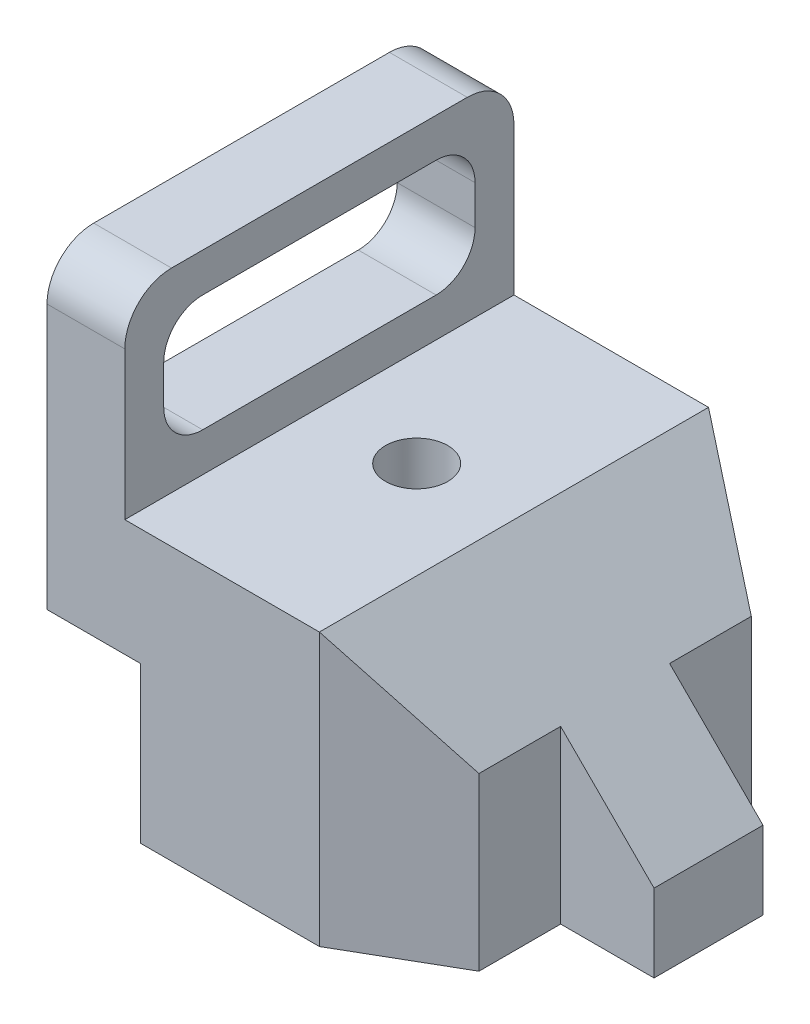
ISO-10303-21;
HEADER;
FILE_DESCRIPTION(('STEP AP214'),'2;1');
FILE_NAME('part.step','',(''),(''),'','','');
FILE_SCHEMA(('AUTOMOTIVE_DESIGN { 1 0 10303 214 1 1 1 1 }'));
ENDSEC;
DATA;
#1=APPLICATION_CONTEXT('core data for automotive mechanical design processes');
#2=APPLICATION_PROTOCOL_DEFINITION('international standard','automotive_design',2000,#1);
#3=PRODUCT_CONTEXT('',#1,'mechanical');
#4=PRODUCT('Part','Part','',(#3));
#5=PRODUCT_RELATED_PRODUCT_CATEGORY('part','',(#4));
#6=PRODUCT_DEFINITION_FORMATION('','',#4);
#7=PRODUCT_DEFINITION_CONTEXT('part definition',#1,'design');
#8=PRODUCT_DEFINITION('design','',#6,#7);
#9=PRODUCT_DEFINITION_SHAPE('','',#8);
#10=(LENGTH_UNIT() NAMED_UNIT(*) SI_UNIT(.MILLI.,.METRE.));
#11=(NAMED_UNIT(*) PLANE_ANGLE_UNIT() SI_UNIT($,.RADIAN.));
#12=(NAMED_UNIT(*) SI_UNIT($,.STERADIAN.) SOLID_ANGLE_UNIT());
#13=UNCERTAINTY_MEASURE_WITH_UNIT(LENGTH_MEASURE(1.E-05),#10,'distance_accuracy_value','');
#14=(GEOMETRIC_REPRESENTATION_CONTEXT(3) GLOBAL_UNCERTAINTY_ASSIGNED_CONTEXT((#13)) GLOBAL_UNIT_ASSIGNED_CONTEXT((#10,
#11,#12)) REPRESENTATION_CONTEXT('',''));
#15=CARTESIAN_POINT('',(0.,0.,0.));
#16=DIRECTION('',(0.,0.,1.));
#17=DIRECTION('',(1.,0.,0.));
#18=AXIS2_PLACEMENT_3D('',#15,#16,#17);
#19=CARTESIAN_POINT('',(0.,0.,25.));
#20=DIRECTION('',(0.,-1.,0.));
#21=DIRECTION('',(1.,0.,0.));
#22=AXIS2_PLACEMENT_3D('',#19,#20,#21);
#23=PLANE('',#22);
#24=DIRECTION('',(0.,0.,-1.));
#25=VECTOR('',#24,1.);
#26=CARTESIAN_POINT('',(-12.,0.,0.));
#27=LINE('',#26,#25);
#28=CARTESIAN_POINT('',(-12.,0.,-7.));
#29=VERTEX_POINT('',#28);
#30=CARTESIAN_POINT('',(-12.,0.,-17.494446500535));
#31=VERTEX_POINT('',#30);
#32=EDGE_CURVE('E314',#29,#31,#27,.T.);
#33=ORIENTED_EDGE('',*,*,#32,.F.);
#34=DIRECTION('',(-1.,0.,0.));
#35=VECTOR('',#34,1.);
#36=CARTESIAN_POINT('',(0.,0.,-7.));
#37=LINE('',#36,#35);
#38=CARTESIAN_POINT('',(0.,0.,-7.));
#39=VERTEX_POINT('',#38);
#40=EDGE_CURVE('E317',#39,#29,#37,.T.);
#41=ORIENTED_EDGE('',*,*,#40,.F.);
#42=DIRECTION('',(0.,0.,-1.));
#43=VECTOR('',#42,1.);
#44=CARTESIAN_POINT('',(0.,0.,25.));
#45=LINE('',#44,#43);
#46=CARTESIAN_POINT('',(0.,0.,7.));
#47=VERTEX_POINT('',#46);
#48=EDGE_CURVE('E427',#47,#39,#45,.T.);
#49=ORIENTED_EDGE('',*,*,#48,.F.);
#50=DIRECTION('',(-1.,0.,0.));
#51=VECTOR('',#50,1.);
#52=CARTESIAN_POINT('',(0.,0.,7.));
#53=LINE('',#52,#51);
#54=CARTESIAN_POINT('',(-12.,0.,7.));
#55=VERTEX_POINT('',#54);
#56=EDGE_CURVE('E296',#47,#55,#53,.T.);
#57=ORIENTED_EDGE('',*,*,#56,.T.);
#58=DIRECTION('',(0.,0.,1.));
#59=VECTOR('',#58,1.);
#60=CARTESIAN_POINT('',(-12.,0.,0.));
#61=LINE('',#60,#59);
#62=CARTESIAN_POINT('',(-12.,0.,17.494446500535));
#63=VERTEX_POINT('',#62);
#64=EDGE_CURVE('E332',#55,#63,#61,.T.);
#65=ORIENTED_EDGE('',*,*,#64,.T.);
#66=DIRECTION('',(0.866025403784442,0.,-0.499999999999995));
#67=VECTOR('',#66,1.);
#68=CARTESIAN_POINT('',(4.57531754730554,0.,7.92468245269472));
#69=LINE('',#68,#67);
#70=CARTESIAN_POINT('',(-25.,0.,25.));
#71=VERTEX_POINT('',#70);
#72=EDGE_CURVE('E348',#71,#63,#69,.T.);
#73=ORIENTED_EDGE('',*,*,#72,.F.);
#74=DIRECTION('',(-1.,0.,0.));
#75=VECTOR('',#74,1.);
#76=CARTESIAN_POINT('',(0.,0.,25.));
#77=LINE('',#76,#75);
#78=CARTESIAN_POINT('',(-48.,0.,25.));
#79=VERTEX_POINT('',#78);
#80=EDGE_CURVE('E379',#71,#79,#77,.T.);
#81=ORIENTED_EDGE('',*,*,#80,.T.);
#82=DIRECTION('',(0.,0.,-1.));
#83=VECTOR('',#82,1.);
#84=CARTESIAN_POINT('',(-48.,0.,25.));
#85=LINE('',#84,#83);
#86=CARTESIAN_POINT('',(-48.,0.,-25.));
#87=VERTEX_POINT('',#86);
#88=EDGE_CURVE('E431',#79,#87,#85,.T.);
#89=ORIENTED_EDGE('',*,*,#88,.T.);
#90=DIRECTION('',(-1.,0.,0.));
#91=VECTOR('',#90,1.);
#92=CARTESIAN_POINT('',(0.,0.,-25.));
#93=LINE('',#92,#91);
#94=CARTESIAN_POINT('',(-25.,0.,-25.));
#95=VERTEX_POINT('',#94);
#96=EDGE_CURVE('E401',#95,#87,#93,.T.);
#97=ORIENTED_EDGE('',*,*,#96,.F.);
#98=DIRECTION('',(0.866025403784442,0.,0.499999999999995));
#99=VECTOR('',#98,1.);
#100=CARTESIAN_POINT('',(4.57531754730554,0.,-7.92468245269473));
#101=LINE('',#100,#99);
#102=EDGE_CURVE('E349',#95,#31,#101,.T.);
#103=ORIENTED_EDGE('',*,*,#102,.T.);
#104=EDGE_LOOP('',(#33,#41,#49,#57,#65,#73,#81,#89,#97,#103));
#105=FACE_BOUND('',#104,.T.);
#106=CARTESIAN_POINT('',(-37.5,0.,0.));
#107=DIRECTION('',(0.,1.,0.));
#108=DIRECTION('',(0.,0.,1.));
#109=AXIS2_PLACEMENT_3D('',#106,#107,#108);
#110=CIRCLE('',#109,4.00000000000001);
#111=CARTESIAN_POINT('',(-37.5,0.,4.00000000000001));
#112=VERTEX_POINT('',#111);
#113=EDGE_CURVE('E362',#112,#112,#110,.T.);
#114=ORIENTED_EDGE('',*,*,#113,.T.);
#115=EDGE_LOOP('',(#114));
#116=FACE_BOUND('',#115,.T.);
#117=ADVANCED_FACE('F52',(#105,#116),#23,.T.);
#118=CARTESIAN_POINT('',(0.,0.,25.));
#119=DIRECTION('',(1.,0.,0.));
#120=DIRECTION('',(0.,1.,0.));
#121=AXIS2_PLACEMENT_3D('',#118,#119,#120);
#122=PLANE('',#121);
#123=DIRECTION('',(0.,-1.,0.));
#124=VECTOR('',#123,1.);
#125=CARTESIAN_POINT('',(0.,60.,-7.));
#126=LINE('',#125,#124);
#127=CARTESIAN_POINT('',(0.,9.99999999999995,-7.));
#128=VERTEX_POINT('',#127);
#129=EDGE_CURVE('E322',#128,#39,#126,.T.);
#130=ORIENTED_EDGE('',*,*,#129,.F.);
#131=DIRECTION('',(0.,0.,-1.));
#132=VECTOR('',#131,1.);
#133=CARTESIAN_POINT('',(0.,9.99999999999992,25.));
#134=LINE('',#133,#132);
#135=CARTESIAN_POINT('',(0.,9.99999999999994,7.));
#136=VERTEX_POINT('',#135);
#137=EDGE_CURVE('E423',#136,#128,#134,.T.);
#138=ORIENTED_EDGE('',*,*,#137,.F.);
#139=DIRECTION('',(0.,-1.,0.));
#140=VECTOR('',#139,1.);
#141=CARTESIAN_POINT('',(0.,60.,7.));
#142=LINE('',#141,#140);
#143=EDGE_CURVE('E318',#136,#47,#142,.T.);
#144=ORIENTED_EDGE('',*,*,#143,.T.);
#145=ORIENTED_EDGE('',*,*,#48,.T.);
#146=EDGE_LOOP('',(#130,#138,#144,#145));
#147=FACE_BOUND('',#146,.T.);
#148=ADVANCED_FACE('F534',(#147),#122,.T.);
#149=CARTESIAN_POINT('',(4.99999999999997,4.99999999999995,25.));
#150=DIRECTION('',(0.707106781186549,0.707106781186547,0.));
#151=DIRECTION('',(-0.707106781186547,0.707106781186549,0.));
#152=AXIS2_PLACEMENT_3D('',#149,#150,#151);
#153=PLANE('',#152);
#154=DIRECTION('',(0.,0.,1.));
#155=VECTOR('',#154,1.);
#156=CARTESIAN_POINT('',(-12.,22.,25.));
#157=LINE('',#156,#155);
#158=CARTESIAN_POINT('',(-12.,22.,-17.494446500535));
#159=VERTEX_POINT('',#158);
#160=CARTESIAN_POINT('',(-12.,22.,-7.));
#161=VERTEX_POINT('',#160);
#162=EDGE_CURVE('E345',#159,#161,#157,.T.);
#163=ORIENTED_EDGE('',*,*,#162,.F.);
#164=DIRECTION('',(-0.654653670707978,0.65465367070798,-0.377964473009222));
#165=VECTOR('',#164,1.);
#166=CARTESIAN_POINT('',(13.0860771969205,-3.08607719692059,-3.01099307798141));
#167=LINE('',#166,#165);
#168=CARTESIAN_POINT('',(-25.,35.,-25.));
#169=VERTEX_POINT('',#168);
#170=EDGE_CURVE('E353',#159,#169,#167,.T.);
#171=ORIENTED_EDGE('',*,*,#170,.T.);
#172=DIRECTION('',(0.,0.,-1.));
#173=VECTOR('',#172,1.);
#174=CARTESIAN_POINT('',(-25.,35.,25.));
#175=LINE('',#174,#173);
#176=CARTESIAN_POINT('',(-25.,35.,25.));
#177=VERTEX_POINT('',#176);
#178=EDGE_CURVE('E419',#177,#169,#175,.T.);
#179=ORIENTED_EDGE('',*,*,#178,.F.);
#180=DIRECTION('',(-0.654653670707978,0.65465367070798,0.377964473009222));
#181=VECTOR('',#180,1.);
#182=CARTESIAN_POINT('',(0.714285714285795,9.28571428571413,10.1538502208383));
#183=LINE('',#182,#181);
#184=CARTESIAN_POINT('',(-12.,22.,17.494446500535));
#185=VERTEX_POINT('',#184);
#186=EDGE_CURVE('E359',#185,#177,#183,.T.);
#187=ORIENTED_EDGE('',*,*,#186,.F.);
#188=DIRECTION('',(0.,0.,-1.));
#189=VECTOR('',#188,1.);
#190=CARTESIAN_POINT('',(-12.,22.,25.));
#191=LINE('',#190,#189);
#192=CARTESIAN_POINT('',(-12.,22.,7.));
#193=VERTEX_POINT('',#192);
#194=EDGE_CURVE('E328',#185,#193,#191,.T.);
#195=ORIENTED_EDGE('',*,*,#194,.T.);
#196=DIRECTION('',(0.707106781186547,-0.707106781186549,0.));
#197=VECTOR('',#196,1.);
#198=CARTESIAN_POINT('',(4.99999999999997,4.99999999999995,7.));
#199=LINE('',#198,#197);
#200=EDGE_CURVE('E457',#193,#136,#199,.T.);
#201=ORIENTED_EDGE('',*,*,#200,.T.);
#202=ORIENTED_EDGE('',*,*,#137,.T.);
#203=DIRECTION('',(0.707106781186547,-0.707106781186549,0.));
#204=VECTOR('',#203,1.);
#205=CARTESIAN_POINT('',(4.99999999999996,4.99999999999995,-7.));
#206=LINE('',#205,#204);
#207=EDGE_CURVE('E461',#161,#128,#206,.T.);
#208=ORIENTED_EDGE('',*,*,#207,.F.);
#209=EDGE_LOOP('',(#163,#171,#179,#187,#195,#201,#202,#208));
#210=FACE_BOUND('',#209,.T.);
#211=ADVANCED_FACE('F539',(#210),#153,.T.);
#212=CARTESIAN_POINT('',(4.57531754730554,60.,7.92468245269472));
#213=DIRECTION('',(-0.499999999999995,0.,-0.866025403784442));
#214=DIRECTION('',(-0.866025403784442,0.,0.499999999999995));
#215=AXIS2_PLACEMENT_3D('',#212,#213,#214);
#216=PLANE('',#215);
#217=DIRECTION('',(0.,-1.,0.));
#218=VECTOR('',#217,1.);
#219=CARTESIAN_POINT('',(-12.,60.,17.494446500535));
#220=LINE('',#219,#218);
#221=EDGE_CURVE('E451',#185,#63,#220,.T.);
#222=ORIENTED_EDGE('',*,*,#221,.F.);
#223=ORIENTED_EDGE('',*,*,#186,.T.);
#224=DIRECTION('',(0.,-1.,0.));
#225=VECTOR('',#224,1.);
#226=CARTESIAN_POINT('',(-25.,0.,25.));
#227=LINE('',#226,#225);
#228=EDGE_CURVE('E448',#177,#71,#227,.T.);
#229=ORIENTED_EDGE('',*,*,#228,.T.);
#230=ORIENTED_EDGE('',*,*,#72,.T.);
#231=EDGE_LOOP('',(#222,#223,#229,#230));
#232=FACE_BOUND('',#231,.T.);
#233=ADVANCED_FACE('F545',(#232),#216,.F.);
#234=CARTESIAN_POINT('',(0.,0.,-25.));
#235=DIRECTION('',(0.,0.,1.));
#236=DIRECTION('',(1.,0.,0.));
#237=AXIS2_PLACEMENT_3D('',#234,#235,#236);
#238=PLANE('',#237);
#239=DIRECTION('',(0.,1.,0.));
#240=VECTOR('',#239,1.);
#241=CARTESIAN_POINT('',(-60.,0.,-25.));
#242=LINE('',#241,#240);
#243=CARTESIAN_POINT('',(-60.,20.,-25.));
#244=VERTEX_POINT('',#243);
#245=CARTESIAN_POINT('',(-60.,54.,-25.));
#246=VERTEX_POINT('',#245);
#247=EDGE_CURVE('E389',#244,#246,#242,.T.);
#248=ORIENTED_EDGE('',*,*,#247,.T.);
#249=DIRECTION('',(1.,0.,0.));
#250=VECTOR('',#249,1.);
#251=CARTESIAN_POINT('',(-50.,54.,-25.));
#252=LINE('',#251,#250);
#253=CARTESIAN_POINT('',(-50.,54.,-25.));
#254=VERTEX_POINT('',#253);
#255=EDGE_CURVE('E464',#246,#254,#252,.T.);
#256=ORIENTED_EDGE('',*,*,#255,.T.);
#257=DIRECTION('',(0.,1.,0.));
#258=VECTOR('',#257,1.);
#259=CARTESIAN_POINT('',(-50.,0.,-25.));
#260=LINE('',#259,#258);
#261=CARTESIAN_POINT('',(-50.,35.,-25.));
#262=VERTEX_POINT('',#261);
#263=EDGE_CURVE('E371',#262,#254,#260,.T.);
#264=ORIENTED_EDGE('',*,*,#263,.F.);
#265=DIRECTION('',(-1.,0.,0.));
#266=VECTOR('',#265,1.);
#267=CARTESIAN_POINT('',(0.,35.,-25.));
#268=LINE('',#267,#266);
#269=EDGE_CURVE('E404',#169,#262,#268,.T.);
#270=ORIENTED_EDGE('',*,*,#269,.F.);
#271=DIRECTION('',(0.,1.,0.));
#272=VECTOR('',#271,1.);
#273=CARTESIAN_POINT('',(-25.,0.,-25.));
#274=LINE('',#273,#272);
#275=EDGE_CURVE('E441',#95,#169,#274,.T.);
#276=ORIENTED_EDGE('',*,*,#275,.F.);
#277=ORIENTED_EDGE('',*,*,#96,.T.);
#278=DIRECTION('',(0.,-1.,0.));
#279=VECTOR('',#278,1.);
#280=CARTESIAN_POINT('',(-48.,0.,-25.));
#281=LINE('',#280,#279);
#282=CARTESIAN_POINT('',(-48.,20.,-25.));
#283=VERTEX_POINT('',#282);
#284=EDGE_CURVE('E397',#283,#87,#281,.T.);
#285=ORIENTED_EDGE('',*,*,#284,.F.);
#286=DIRECTION('',(-1.,0.,0.));
#287=VECTOR('',#286,1.);
#288=CARTESIAN_POINT('',(0.,20.,-25.));
#289=LINE('',#288,#287);
#290=EDGE_CURVE('E393',#283,#244,#289,.T.);
#291=ORIENTED_EDGE('',*,*,#290,.T.);
#292=EDGE_LOOP('',(#248,#256,#264,#270,#276,#277,#285,#291));
#293=FACE_BOUND('',#292,.T.);
#294=ADVANCED_FACE('F488',(#293),#238,.F.);
#295=CARTESIAN_POINT('',(-60.,0.,25.));
#296=DIRECTION('',(-1.,0.,0.));
#297=DIRECTION('',(0.,0.,1.));
#298=AXIS2_PLACEMENT_3D('',#295,#296,#297);
#299=PLANE('',#298);
#300=CARTESIAN_POINT('',(-60.,50.,15.));
#301=DIRECTION('',(1.,0.,0.));
#302=DIRECTION('',(0.,0.,-1.));
#303=AXIS2_PLACEMENT_3D('',#300,#301,#302);
#304=CIRCLE('',#303,5.);
#305=CARTESIAN_POINT('',(-60.,55.,15.));
#306=VERTEX_POINT('',#305);
#307=CARTESIAN_POINT('',(-60.,50.,20.));
#308=VERTEX_POINT('',#307);
#309=EDGE_CURVE('E220',#306,#308,#304,.T.);
#310=ORIENTED_EDGE('',*,*,#309,.T.);
#311=DIRECTION('',(0.,-1.,0.));
#312=VECTOR('',#311,1.);
#313=CARTESIAN_POINT('',(-60.,50.,20.));
#314=LINE('',#313,#312);
#315=CARTESIAN_POINT('',(-60.,45.,20.));
#316=VERTEX_POINT('',#315);
#317=EDGE_CURVE('E233',#308,#316,#314,.T.);
#318=ORIENTED_EDGE('',*,*,#317,.T.);
#319=CARTESIAN_POINT('',(-60.,45.,15.));
#320=DIRECTION('',(1.,0.,0.));
#321=DIRECTION('',(0.,0.,-1.));
#322=AXIS2_PLACEMENT_3D('',#319,#320,#321);
#323=CIRCLE('',#322,5.);
#324=CARTESIAN_POINT('',(-60.,40.,15.));
#325=VERTEX_POINT('',#324);
#326=EDGE_CURVE('E238',#316,#325,#323,.T.);
#327=ORIENTED_EDGE('',*,*,#326,.T.);
#328=DIRECTION('',(0.,0.,-1.));
#329=VECTOR('',#328,1.);
#330=CARTESIAN_POINT('',(-60.,40.,15.));
#331=LINE('',#330,#329);
#332=CARTESIAN_POINT('',(-60.,40.,-15.));
#333=VERTEX_POINT('',#332);
#334=EDGE_CURVE('E253',#325,#333,#331,.T.);
#335=ORIENTED_EDGE('',*,*,#334,.T.);
#336=CARTESIAN_POINT('',(-60.,45.,-15.));
#337=DIRECTION('',(1.,0.,0.));
#338=DIRECTION('',(0.,0.,-1.));
#339=AXIS2_PLACEMENT_3D('',#336,#337,#338);
#340=CIRCLE('',#339,5.);
#341=CARTESIAN_POINT('',(-60.,45.,-20.));
#342=VERTEX_POINT('',#341);
#343=EDGE_CURVE('E257',#333,#342,#340,.T.);
#344=ORIENTED_EDGE('',*,*,#343,.T.);
#345=DIRECTION('',(0.,-1.,0.));
#346=VECTOR('',#345,1.);
#347=CARTESIAN_POINT('',(-60.,50.,-20.));
#348=LINE('',#347,#346);
#349=CARTESIAN_POINT('',(-60.,50.,-20.));
#350=VERTEX_POINT('',#349);
#351=EDGE_CURVE('E261',#350,#342,#348,.T.);
#352=ORIENTED_EDGE('',*,*,#351,.F.);
#353=CARTESIAN_POINT('',(-60.,50.,-15.));
#354=DIRECTION('',(1.,0.,0.));
#355=DIRECTION('',(0.,0.,-1.));
#356=AXIS2_PLACEMENT_3D('',#353,#354,#355);
#357=CIRCLE('',#356,5.);
#358=CARTESIAN_POINT('',(-60.,55.,-15.));
#359=VERTEX_POINT('',#358);
#360=EDGE_CURVE('E264',#350,#359,#357,.T.);
#361=ORIENTED_EDGE('',*,*,#360,.T.);
#362=DIRECTION('',(0.,0.,-1.));
#363=VECTOR('',#362,1.);
#364=CARTESIAN_POINT('',(-60.,55.,15.));
#365=LINE('',#364,#363);
#366=EDGE_CURVE('E229',#306,#359,#365,.T.);
#367=ORIENTED_EDGE('',*,*,#366,.F.);
#368=EDGE_LOOP('',(#310,#318,#327,#335,#344,#352,#361,#367));
#369=FACE_BOUND('',#368,.T.);
#370=DIRECTION('',(0.,0.,-1.));
#371=VECTOR('',#370,1.);
#372=CARTESIAN_POINT('',(-60.,60.,25.));
#373=LINE('',#372,#371);
#374=CARTESIAN_POINT('',(-60.,60.,19.));
#375=VERTEX_POINT('',#374);
#376=CARTESIAN_POINT('',(-60.,60.,-19.));
#377=VERTEX_POINT('',#376);
#378=EDGE_CURVE('E388',#375,#377,#373,.T.);
#379=ORIENTED_EDGE('',*,*,#378,.T.);
#380=CARTESIAN_POINT('',(-60.,54.,-19.));
#381=DIRECTION('',(-1.,0.,0.));
#382=DIRECTION('',(0.,0.,1.));
#383=AXIS2_PLACEMENT_3D('',#380,#381,#382);
#384=CIRCLE('',#383,6.);
#385=EDGE_CURVE('E61',#377,#246,#384,.T.);
#386=ORIENTED_EDGE('',*,*,#385,.T.);
#387=ORIENTED_EDGE('',*,*,#247,.F.);
#388=DIRECTION('',(0.,0.,-1.));
#389=VECTOR('',#388,1.);
#390=CARTESIAN_POINT('',(-60.,20.,25.));
#391=LINE('',#390,#389);
#392=CARTESIAN_POINT('',(-60.,20.,25.));
#393=VERTEX_POINT('',#392);
#394=EDGE_CURVE('E438',#393,#244,#391,.T.);
#395=ORIENTED_EDGE('',*,*,#394,.F.);
#396=DIRECTION('',(0.,1.,0.));
#397=VECTOR('',#396,1.);
#398=CARTESIAN_POINT('',(-60.,0.,25.));
#399=LINE('',#398,#397);
#400=CARTESIAN_POINT('',(-60.,54.,25.));
#401=VERTEX_POINT('',#400);
#402=EDGE_CURVE('E367',#393,#401,#399,.T.);
#403=ORIENTED_EDGE('',*,*,#402,.T.);
#404=CARTESIAN_POINT('',(-60.,54.,19.));
#405=DIRECTION('',(-1.,0.,0.));
#406=DIRECTION('',(0.,0.,1.));
#407=AXIS2_PLACEMENT_3D('',#404,#405,#406);
#408=CIRCLE('',#407,6.);
#409=EDGE_CURVE('E480',#401,#375,#408,.T.);
#410=ORIENTED_EDGE('',*,*,#409,.T.);
#411=EDGE_LOOP('',(#379,#386,#387,#395,#403,#410));
#412=FACE_BOUND('',#411,.T.);
#413=ADVANCED_FACE('F240',(#369,#412),#299,.T.);
#414=CARTESIAN_POINT('',(0.,20.,25.));
#415=DIRECTION('',(0.,-1.,0.));
#416=DIRECTION('',(0.,0.,-1.));
#417=AXIS2_PLACEMENT_3D('',#414,#415,#416);
#418=PLANE('',#417);
#419=ORIENTED_EDGE('',*,*,#290,.F.);
#420=DIRECTION('',(0.,0.,-1.));
#421=VECTOR('',#420,1.);
#422=CARTESIAN_POINT('',(-48.,20.,25.));
#423=LINE('',#422,#421);
#424=CARTESIAN_POINT('',(-48.,20.,25.));
#425=VERTEX_POINT('',#424);
#426=EDGE_CURVE('E435',#425,#283,#423,.T.);
#427=ORIENTED_EDGE('',*,*,#426,.F.);
#428=DIRECTION('',(-1.,0.,0.));
#429=VECTOR('',#428,1.);
#430=CARTESIAN_POINT('',(0.,20.,25.));
#431=LINE('',#430,#429);
#432=EDGE_CURVE('E370',#425,#393,#431,.T.);
#433=ORIENTED_EDGE('',*,*,#432,.T.);
#434=ORIENTED_EDGE('',*,*,#394,.T.);
#435=EDGE_LOOP('',(#419,#427,#433,#434));
#436=FACE_BOUND('',#435,.T.);
#437=ADVANCED_FACE('F523',(#436),#418,.T.);
#438=CARTESIAN_POINT('',(-48.,0.,25.));
#439=DIRECTION('',(1.,0.,0.));
#440=DIRECTION('',(0.,0.,-1.));
#441=AXIS2_PLACEMENT_3D('',#438,#439,#440);
#442=PLANE('',#441);
#443=ORIENTED_EDGE('',*,*,#284,.T.);
#444=ORIENTED_EDGE('',*,*,#88,.F.);
#445=DIRECTION('',(0.,-1.,0.));
#446=VECTOR('',#445,1.);
#447=CARTESIAN_POINT('',(-48.,0.,25.));
#448=LINE('',#447,#446);
#449=EDGE_CURVE('E375',#425,#79,#448,.T.);
#450=ORIENTED_EDGE('',*,*,#449,.F.);
#451=ORIENTED_EDGE('',*,*,#426,.T.);
#452=EDGE_LOOP('',(#443,#444,#450,#451));
#453=FACE_BOUND('',#452,.T.);
#454=ADVANCED_FACE('F521',(#453),#442,.F.);
#455=CARTESIAN_POINT('',(0.,35.,25.));
#456=DIRECTION('',(0.,-1.,0.));
#457=DIRECTION('',(0.,0.,-1.));
#458=AXIS2_PLACEMENT_3D('',#455,#456,#457);
#459=PLANE('',#458);
#460=CARTESIAN_POINT('',(-37.5,35.,0.));
#461=DIRECTION('',(0.,-1.,0.));
#462=DIRECTION('',(0.,0.,-1.));
#463=AXIS2_PLACEMENT_3D('',#460,#461,#462);
#464=CIRCLE('',#463,4.00000000000001);
#465=CARTESIAN_POINT('',(-37.5,35.,-4.00000000000001));
#466=VERTEX_POINT('',#465);
#467=EDGE_CURVE('E366',#466,#466,#464,.F.);
#468=ORIENTED_EDGE('',*,*,#467,.F.);
#469=EDGE_LOOP('',(#468));
#470=FACE_BOUND('',#469,.T.);
#471=ORIENTED_EDGE('',*,*,#269,.T.);
#472=DIRECTION('',(0.,0.,-1.));
#473=VECTOR('',#472,1.);
#474=CARTESIAN_POINT('',(-50.,35.,25.));
#475=LINE('',#474,#473);
#476=CARTESIAN_POINT('',(-50.,35.,25.));
#477=VERTEX_POINT('',#476);
#478=EDGE_CURVE('E415',#477,#262,#475,.T.);
#479=ORIENTED_EDGE('',*,*,#478,.F.);
#480=DIRECTION('',(-1.,0.,0.));
#481=VECTOR('',#480,1.);
#482=CARTESIAN_POINT('',(0.,35.,25.));
#483=LINE('',#482,#481);
#484=EDGE_CURVE('E382',#177,#477,#483,.T.);
#485=ORIENTED_EDGE('',*,*,#484,.F.);
#486=ORIENTED_EDGE('',*,*,#178,.T.);
#487=EDGE_LOOP('',(#471,#479,#485,#486));
#488=FACE_BOUND('',#487,.T.);
#489=ADVANCED_FACE('F508',(#470,#488),#459,.F.);
#490=CARTESIAN_POINT('',(-50.,0.,25.));
#491=DIRECTION('',(-1.,0.,0.));
#492=DIRECTION('',(0.,0.,1.));
#493=AXIS2_PLACEMENT_3D('',#490,#491,#492);
#494=PLANE('',#493);
#495=DIRECTION('',(0.,-1.,0.));
#496=VECTOR('',#495,1.);
#497=CARTESIAN_POINT('',(-50.,50.,20.));
#498=LINE('',#497,#496);
#499=CARTESIAN_POINT('',(-50.,50.,20.));
#500=VERTEX_POINT('',#499);
#501=CARTESIAN_POINT('',(-50.,45.,20.));
#502=VERTEX_POINT('',#501);
#503=EDGE_CURVE('E271',#500,#502,#498,.T.);
#504=ORIENTED_EDGE('',*,*,#503,.F.);
#505=CARTESIAN_POINT('',(-50.,50.,15.));
#506=DIRECTION('',(1.,0.,0.));
#507=DIRECTION('',(0.,0.,-1.));
#508=AXIS2_PLACEMENT_3D('',#505,#506,#507);
#509=CIRCLE('',#508,5.);
#510=CARTESIAN_POINT('',(-50.,55.,15.));
#511=VERTEX_POINT('',#510);
#512=EDGE_CURVE('E223',#511,#500,#509,.T.);
#513=ORIENTED_EDGE('',*,*,#512,.F.);
#514=DIRECTION('',(0.,0.,-1.));
#515=VECTOR('',#514,1.);
#516=CARTESIAN_POINT('',(-50.,55.,15.));
#517=LINE('',#516,#515);
#518=CARTESIAN_POINT('',(-50.,55.,-15.));
#519=VERTEX_POINT('',#518);
#520=EDGE_CURVE('E244',#511,#519,#517,.T.);
#521=ORIENTED_EDGE('',*,*,#520,.T.);
#522=CARTESIAN_POINT('',(-50.,50.,-15.));
#523=DIRECTION('',(1.,0.,0.));
#524=DIRECTION('',(0.,0.,-1.));
#525=AXIS2_PLACEMENT_3D('',#522,#523,#524);
#526=CIRCLE('',#525,5.);
#527=CARTESIAN_POINT('',(-50.,50.,-20.));
#528=VERTEX_POINT('',#527);
#529=EDGE_CURVE('E248',#528,#519,#526,.T.);
#530=ORIENTED_EDGE('',*,*,#529,.F.);
#531=DIRECTION('',(0.,-1.,0.));
#532=VECTOR('',#531,1.);
#533=CARTESIAN_POINT('',(-50.,50.,-20.));
#534=LINE('',#533,#532);
#535=CARTESIAN_POINT('',(-50.,45.,-20.));
#536=VERTEX_POINT('',#535);
#537=EDGE_CURVE('E286',#528,#536,#534,.T.);
#538=ORIENTED_EDGE('',*,*,#537,.T.);
#539=CARTESIAN_POINT('',(-50.,45.,-15.));
#540=DIRECTION('',(1.,0.,0.));
#541=DIRECTION('',(0.,0.,-1.));
#542=AXIS2_PLACEMENT_3D('',#539,#540,#541);
#543=CIRCLE('',#542,5.);
#544=CARTESIAN_POINT('',(-50.,40.,-15.));
#545=VERTEX_POINT('',#544);
#546=EDGE_CURVE('E282',#545,#536,#543,.T.);
#547=ORIENTED_EDGE('',*,*,#546,.F.);
#548=DIRECTION('',(0.,0.,-1.));
#549=VECTOR('',#548,1.);
#550=CARTESIAN_POINT('',(-50.,40.,15.));
#551=LINE('',#550,#549);
#552=CARTESIAN_POINT('',(-50.,40.,15.));
#553=VERTEX_POINT('',#552);
#554=EDGE_CURVE('E278',#553,#545,#551,.T.);
#555=ORIENTED_EDGE('',*,*,#554,.F.);
#556=CARTESIAN_POINT('',(-50.,45.,15.));
#557=DIRECTION('',(1.,0.,0.));
#558=DIRECTION('',(0.,0.,-1.));
#559=AXIS2_PLACEMENT_3D('',#556,#557,#558);
#560=CIRCLE('',#559,5.);
#561=EDGE_CURVE('E274',#502,#553,#560,.T.);
#562=ORIENTED_EDGE('',*,*,#561,.F.);
#563=EDGE_LOOP('',(#504,#513,#521,#530,#538,#547,#555,#562));
#564=FACE_BOUND('',#563,.T.);
#565=ORIENTED_EDGE('',*,*,#263,.T.);
#566=CARTESIAN_POINT('',(-50.,54.,-19.));
#567=DIRECTION('',(-1.,0.,0.));
#568=DIRECTION('',(0.,0.,1.));
#569=AXIS2_PLACEMENT_3D('',#566,#567,#568);
#570=CIRCLE('',#569,6.);
#571=CARTESIAN_POINT('',(-50.,60.,-19.));
#572=VERTEX_POINT('',#571);
#573=EDGE_CURVE('E471',#254,#572,#570,.F.);
#574=ORIENTED_EDGE('',*,*,#573,.T.);
#575=DIRECTION('',(0.,0.,-1.));
#576=VECTOR('',#575,1.);
#577=CARTESIAN_POINT('',(-50.,60.,25.));
#578=LINE('',#577,#576);
#579=CARTESIAN_POINT('',(-50.,60.,19.));
#580=VERTEX_POINT('',#579);
#581=EDGE_CURVE('E412',#580,#572,#578,.T.);
#582=ORIENTED_EDGE('',*,*,#581,.F.);
#583=CARTESIAN_POINT('',(-50.,54.,19.));
#584=DIRECTION('',(-1.,0.,0.));
#585=DIRECTION('',(0.,0.,1.));
#586=AXIS2_PLACEMENT_3D('',#583,#584,#585);
#587=CIRCLE('',#586,6.);
#588=CARTESIAN_POINT('',(-50.,54.,25.));
#589=VERTEX_POINT('',#588);
#590=EDGE_CURVE('E468',#580,#589,#587,.F.);
#591=ORIENTED_EDGE('',*,*,#590,.T.);
#592=DIRECTION('',(0.,1.,0.));
#593=VECTOR('',#592,1.);
#594=CARTESIAN_POINT('',(-50.,0.,25.));
#595=LINE('',#594,#593);
#596=EDGE_CURVE('E385',#477,#589,#595,.T.);
#597=ORIENTED_EDGE('',*,*,#596,.F.);
#598=ORIENTED_EDGE('',*,*,#478,.T.);
#599=EDGE_LOOP('',(#565,#574,#582,#591,#597,#598));
#600=FACE_BOUND('',#599,.T.);
#601=ADVANCED_FACE('F495',(#564,#600),#494,.F.);
#602=CARTESIAN_POINT('',(0.,60.,25.));
#603=DIRECTION('',(0.,1.,0.));
#604=DIRECTION('',(0.,0.,1.));
#605=AXIS2_PLACEMENT_3D('',#602,#603,#604);
#606=PLANE('',#605);
#607=ORIENTED_EDGE('',*,*,#581,.T.);
#608=DIRECTION('',(1.,0.,0.));
#609=VECTOR('',#608,1.);
#610=CARTESIAN_POINT('',(-60.,60.,-19.));
#611=LINE('',#610,#609);
#612=EDGE_CURVE('E74',#572,#377,#611,.F.);
#613=ORIENTED_EDGE('',*,*,#612,.T.);
#614=ORIENTED_EDGE('',*,*,#378,.F.);
#615=DIRECTION('',(1.,0.,0.));
#616=VECTOR('',#615,1.);
#617=CARTESIAN_POINT('',(0.,60.,19.));
#618=LINE('',#617,#616);
#619=EDGE_CURVE('E474',#375,#580,#618,.T.);
#620=ORIENTED_EDGE('',*,*,#619,.T.);
#621=EDGE_LOOP('',(#607,#613,#614,#620));
#622=FACE_BOUND('',#621,.T.);
#623=ADVANCED_FACE('F496',(#622),#606,.T.);
#624=CARTESIAN_POINT('',(0.,0.,25.));
#625=DIRECTION('',(0.,0.,1.));
#626=DIRECTION('',(1.,0.,0.));
#627=AXIS2_PLACEMENT_3D('',#624,#625,#626);
#628=PLANE('',#627);
#629=ORIENTED_EDGE('',*,*,#596,.T.);
#630=DIRECTION('',(1.,0.,0.));
#631=VECTOR('',#630,1.);
#632=CARTESIAN_POINT('',(0.,54.,25.));
#633=LINE('',#632,#631);
#634=EDGE_CURVE('E13',#589,#401,#633,.F.);
#635=ORIENTED_EDGE('',*,*,#634,.T.);
#636=ORIENTED_EDGE('',*,*,#402,.F.);
#637=ORIENTED_EDGE('',*,*,#432,.F.);
#638=ORIENTED_EDGE('',*,*,#449,.T.);
#639=ORIENTED_EDGE('',*,*,#80,.F.);
#640=ORIENTED_EDGE('',*,*,#228,.F.);
#641=ORIENTED_EDGE('',*,*,#484,.T.);
#642=EDGE_LOOP('',(#629,#635,#636,#637,#638,#639,#640,#641));
#643=FACE_BOUND('',#642,.T.);
#644=ADVANCED_FACE('F501',(#643),#628,.T.);
#645=CARTESIAN_POINT('',(-37.5,60.,0.));
#646=DIRECTION('',(0.,-1.,0.));
#647=DIRECTION('',(0.,0.,-1.));
#648=AXIS2_PLACEMENT_3D('',#645,#646,#647);
#649=CYLINDRICAL_SURFACE('',#648,4.00000000000001);
#650=ORIENTED_EDGE('',*,*,#113,.F.);
#651=EDGE_LOOP('',(#650));
#652=FACE_BOUND('',#651,.T.);
#653=ORIENTED_EDGE('',*,*,#467,.T.);
#654=EDGE_LOOP('',(#653));
#655=FACE_BOUND('',#654,.T.);
#656=ADVANCED_FACE('F559',(#652,#655),#649,.F.);
#657=CARTESIAN_POINT('',(4.57531754730554,60.,-7.92468245269473));
#658=DIRECTION('',(0.499999999999995,0.,-0.866025403784442));
#659=DIRECTION('',(-0.866025403784442,0.,-0.499999999999995));
#660=AXIS2_PLACEMENT_3D('',#657,#658,#659);
#661=PLANE('',#660);
#662=DIRECTION('',(0.,1.,0.));
#663=VECTOR('',#662,1.);
#664=CARTESIAN_POINT('',(-12.,60.,-17.494446500535));
#665=LINE('',#664,#663);
#666=EDGE_CURVE('E454',#31,#159,#665,.T.);
#667=ORIENTED_EDGE('',*,*,#666,.F.);
#668=ORIENTED_EDGE('',*,*,#102,.F.);
#669=ORIENTED_EDGE('',*,*,#275,.T.);
#670=ORIENTED_EDGE('',*,*,#170,.F.);
#671=EDGE_LOOP('',(#667,#668,#669,#670));
#672=FACE_BOUND('',#671,.T.);
#673=ADVANCED_FACE('F562',(#672),#661,.T.);
#674=CARTESIAN_POINT('',(0.,60.,7.));
#675=DIRECTION('',(0.,0.,1.));
#676=DIRECTION('',(1.,0.,0.));
#677=AXIS2_PLACEMENT_3D('',#674,#675,#676);
#678=PLANE('',#677);
#679=DIRECTION('',(0.,-1.,0.));
#680=VECTOR('',#679,1.);
#681=CARTESIAN_POINT('',(-12.,60.,7.));
#682=LINE('',#681,#680);
#683=EDGE_CURVE('E336',#193,#55,#682,.T.);
#684=ORIENTED_EDGE('',*,*,#683,.T.);
#685=ORIENTED_EDGE('',*,*,#56,.F.);
#686=ORIENTED_EDGE('',*,*,#143,.F.);
#687=ORIENTED_EDGE('',*,*,#200,.F.);
#688=EDGE_LOOP('',(#684,#685,#686,#687));
#689=FACE_BOUND('',#688,.T.);
#690=ADVANCED_FACE('F569',(#689),#678,.T.);
#691=CARTESIAN_POINT('',(-12.,60.,0.));
#692=DIRECTION('',(1.,0.,0.));
#693=DIRECTION('',(0.,0.,-1.));
#694=AXIS2_PLACEMENT_3D('',#691,#692,#693);
#695=PLANE('',#694);
#696=ORIENTED_EDGE('',*,*,#221,.T.);
#697=ORIENTED_EDGE('',*,*,#64,.F.);
#698=ORIENTED_EDGE('',*,*,#683,.F.);
#699=ORIENTED_EDGE('',*,*,#194,.F.);
#700=EDGE_LOOP('',(#696,#697,#698,#699));
#701=FACE_BOUND('',#700,.T.);
#702=ADVANCED_FACE('F572',(#701),#695,.T.);
#703=CARTESIAN_POINT('',(-12.,60.,0.));
#704=DIRECTION('',(-1.,0.,0.));
#705=DIRECTION('',(0.,0.,1.));
#706=AXIS2_PLACEMENT_3D('',#703,#704,#705);
#707=PLANE('',#706);
#708=ORIENTED_EDGE('',*,*,#162,.T.);
#709=DIRECTION('',(0.,-1.,0.));
#710=VECTOR('',#709,1.);
#711=CARTESIAN_POINT('',(-12.,60.,-7.));
#712=LINE('',#711,#710);
#713=EDGE_CURVE('E325',#161,#29,#712,.T.);
#714=ORIENTED_EDGE('',*,*,#713,.T.);
#715=ORIENTED_EDGE('',*,*,#32,.T.);
#716=ORIENTED_EDGE('',*,*,#666,.T.);
#717=EDGE_LOOP('',(#708,#714,#715,#716));
#718=FACE_BOUND('',#717,.T.);
#719=ADVANCED_FACE('F576',(#718),#707,.F.);
#720=CARTESIAN_POINT('',(0.,60.,-7.));
#721=DIRECTION('',(0.,0.,1.));
#722=DIRECTION('',(1.,0.,0.));
#723=AXIS2_PLACEMENT_3D('',#720,#721,#722);
#724=PLANE('',#723);
#725=ORIENTED_EDGE('',*,*,#207,.T.);
#726=ORIENTED_EDGE('',*,*,#129,.T.);
#727=ORIENTED_EDGE('',*,*,#40,.T.);
#728=ORIENTED_EDGE('',*,*,#713,.F.);
#729=EDGE_LOOP('',(#725,#726,#727,#728));
#730=FACE_BOUND('',#729,.T.);
#731=ADVANCED_FACE('F580',(#730),#724,.F.);
#732=CARTESIAN_POINT('',(-60.,50.,15.));
#733=DIRECTION('',(1.,0.,0.));
#734=DIRECTION('',(0.,0.,-1.));
#735=AXIS2_PLACEMENT_3D('',#732,#733,#734);
#736=CYLINDRICAL_SURFACE('',#735,5.);
#737=ORIENTED_EDGE('',*,*,#512,.T.);
#738=DIRECTION('',(1.,0.,0.));
#739=VECTOR('',#738,1.);
#740=CARTESIAN_POINT('',(-60.,50.,20.));
#741=LINE('',#740,#739);
#742=EDGE_CURVE('E216',#308,#500,#741,.T.);
#743=ORIENTED_EDGE('',*,*,#742,.F.);
#744=ORIENTED_EDGE('',*,*,#309,.F.);
#745=DIRECTION('',(1.,0.,0.));
#746=VECTOR('',#745,1.);
#747=CARTESIAN_POINT('',(-60.,55.,15.));
#748=LINE('',#747,#746);
#749=EDGE_CURVE('E293',#306,#511,#748,.T.);
#750=ORIENTED_EDGE('',*,*,#749,.T.);
#751=EDGE_LOOP('',(#737,#743,#744,#750));
#752=FACE_BOUND('',#751,.T.);
#753=ADVANCED_FACE('F218',(#752),#736,.F.);
#754=CARTESIAN_POINT('',(-60.,55.,15.));
#755=DIRECTION('',(0.,-1.,0.));
#756=DIRECTION('',(0.,0.,-1.));
#757=AXIS2_PLACEMENT_3D('',#754,#755,#756);
#758=PLANE('',#757);
#759=ORIENTED_EDGE('',*,*,#520,.F.);
#760=ORIENTED_EDGE('',*,*,#749,.F.);
#761=ORIENTED_EDGE('',*,*,#366,.T.);
#762=DIRECTION('',(1.,0.,0.));
#763=VECTOR('',#762,1.);
#764=CARTESIAN_POINT('',(-60.,55.,-15.));
#765=LINE('',#764,#763);
#766=EDGE_CURVE('E297',#359,#519,#765,.T.);
#767=ORIENTED_EDGE('',*,*,#766,.T.);
#768=EDGE_LOOP('',(#759,#760,#761,#767));
#769=FACE_BOUND('',#768,.T.);
#770=ADVANCED_FACE('F587',(#769),#758,.T.);
#771=CARTESIAN_POINT('',(-60.,50.,-15.));
#772=DIRECTION('',(1.,0.,0.));
#773=DIRECTION('',(0.,0.,-1.));
#774=AXIS2_PLACEMENT_3D('',#771,#772,#773);
#775=CYLINDRICAL_SURFACE('',#774,5.);
#776=ORIENTED_EDGE('',*,*,#529,.T.);
#777=ORIENTED_EDGE('',*,*,#766,.F.);
#778=ORIENTED_EDGE('',*,*,#360,.F.);
#779=DIRECTION('',(1.,0.,0.));
#780=VECTOR('',#779,1.);
#781=CARTESIAN_POINT('',(-60.,50.,-20.));
#782=LINE('',#781,#780);
#783=EDGE_CURVE('E300',#350,#528,#782,.T.);
#784=ORIENTED_EDGE('',*,*,#783,.T.);
#785=EDGE_LOOP('',(#776,#777,#778,#784));
#786=FACE_BOUND('',#785,.T.);
#787=ADVANCED_FACE('F605',(#786),#775,.F.);
#788=CARTESIAN_POINT('',(-60.,50.,-20.));
#789=DIRECTION('',(0.,0.,1.));
#790=DIRECTION('',(1.,0.,0.));
#791=AXIS2_PLACEMENT_3D('',#788,#789,#790);
#792=PLANE('',#791);
#793=ORIENTED_EDGE('',*,*,#537,.F.);
#794=ORIENTED_EDGE('',*,*,#783,.F.);
#795=ORIENTED_EDGE('',*,*,#351,.T.);
#796=DIRECTION('',(1.,0.,0.));
#797=VECTOR('',#796,1.);
#798=CARTESIAN_POINT('',(-60.,45.,-20.));
#799=LINE('',#798,#797);
#800=EDGE_CURVE('E303',#342,#536,#799,.T.);
#801=ORIENTED_EDGE('',*,*,#800,.T.);
#802=EDGE_LOOP('',(#793,#794,#795,#801));
#803=FACE_BOUND('',#802,.T.);
#804=ADVANCED_FACE('F601',(#803),#792,.T.);
#805=CARTESIAN_POINT('',(-60.,45.,-15.));
#806=DIRECTION('',(1.,0.,0.));
#807=DIRECTION('',(0.,0.,-1.));
#808=AXIS2_PLACEMENT_3D('',#805,#806,#807);
#809=CYLINDRICAL_SURFACE('',#808,5.);
#810=ORIENTED_EDGE('',*,*,#546,.T.);
#811=ORIENTED_EDGE('',*,*,#800,.F.);
#812=ORIENTED_EDGE('',*,*,#343,.F.);
#813=DIRECTION('',(1.,0.,0.));
#814=VECTOR('',#813,1.);
#815=CARTESIAN_POINT('',(-60.,40.,-15.));
#816=LINE('',#815,#814);
#817=EDGE_CURVE('E306',#333,#545,#816,.T.);
#818=ORIENTED_EDGE('',*,*,#817,.T.);
#819=EDGE_LOOP('',(#810,#811,#812,#818));
#820=FACE_BOUND('',#819,.T.);
#821=ADVANCED_FACE('F597',(#820),#809,.F.);
#822=CARTESIAN_POINT('',(-60.,40.,15.));
#823=DIRECTION('',(0.,-1.,0.));
#824=DIRECTION('',(0.,0.,-1.));
#825=AXIS2_PLACEMENT_3D('',#822,#823,#824);
#826=PLANE('',#825);
#827=ORIENTED_EDGE('',*,*,#554,.T.);
#828=ORIENTED_EDGE('',*,*,#817,.F.);
#829=ORIENTED_EDGE('',*,*,#334,.F.);
#830=DIRECTION('',(1.,0.,0.));
#831=VECTOR('',#830,1.);
#832=CARTESIAN_POINT('',(-60.,40.,15.));
#833=LINE('',#832,#831);
#834=EDGE_CURVE('E309',#325,#553,#833,.T.);
#835=ORIENTED_EDGE('',*,*,#834,.T.);
#836=EDGE_LOOP('',(#827,#828,#829,#835));
#837=FACE_BOUND('',#836,.T.);
#838=ADVANCED_FACE('F593',(#837),#826,.F.);
#839=CARTESIAN_POINT('',(-60.,45.,15.));
#840=DIRECTION('',(1.,0.,0.));
#841=DIRECTION('',(0.,0.,-1.));
#842=AXIS2_PLACEMENT_3D('',#839,#840,#841);
#843=CYLINDRICAL_SURFACE('',#842,5.);
#844=ORIENTED_EDGE('',*,*,#561,.T.);
#845=ORIENTED_EDGE('',*,*,#834,.F.);
#846=ORIENTED_EDGE('',*,*,#326,.F.);
#847=DIRECTION('',(1.,0.,0.));
#848=VECTOR('',#847,1.);
#849=CARTESIAN_POINT('',(-60.,45.,20.));
#850=LINE('',#849,#848);
#851=EDGE_CURVE('E228',#316,#502,#850,.T.);
#852=ORIENTED_EDGE('',*,*,#851,.T.);
#853=EDGE_LOOP('',(#844,#845,#846,#852));
#854=FACE_BOUND('',#853,.T.);
#855=ADVANCED_FACE('F590',(#854),#843,.F.);
#856=CARTESIAN_POINT('',(-60.,50.,20.));
#857=DIRECTION('',(0.,0.,1.));
#858=DIRECTION('',(1.,0.,0.));
#859=AXIS2_PLACEMENT_3D('',#856,#857,#858);
#860=PLANE('',#859);
#861=ORIENTED_EDGE('',*,*,#503,.T.);
#862=ORIENTED_EDGE('',*,*,#851,.F.);
#863=ORIENTED_EDGE('',*,*,#317,.F.);
#864=ORIENTED_EDGE('',*,*,#742,.T.);
#865=EDGE_LOOP('',(#861,#862,#863,#864));
#866=FACE_BOUND('',#865,.T.);
#867=ADVANCED_FACE('F234',(#866),#860,.F.);
#868=CARTESIAN_POINT('',(0.,54.,-19.));
#869=DIRECTION('',(-1.,0.,0.));
#870=DIRECTION('',(0.,0.,1.));
#871=AXIS2_PLACEMENT_3D('',#868,#869,#870);
#872=CYLINDRICAL_SURFACE('',#871,6.);
#873=ORIENTED_EDGE('',*,*,#385,.F.);
#874=ORIENTED_EDGE('',*,*,#612,.F.);
#875=ORIENTED_EDGE('',*,*,#573,.F.);
#876=ORIENTED_EDGE('',*,*,#255,.F.);
#877=EDGE_LOOP('',(#873,#874,#875,#876));
#878=FACE_BOUND('',#877,.T.);
#879=ADVANCED_FACE('F492',(#878),#872,.T.);
#880=CARTESIAN_POINT('',(0.,54.,19.));
#881=DIRECTION('',(1.,0.,0.));
#882=DIRECTION('',(0.,0.,-1.));
#883=AXIS2_PLACEMENT_3D('',#880,#881,#882);
#884=CYLINDRICAL_SURFACE('',#883,6.);
#885=ORIENTED_EDGE('',*,*,#409,.F.);
#886=ORIENTED_EDGE('',*,*,#634,.F.);
#887=ORIENTED_EDGE('',*,*,#590,.F.);
#888=ORIENTED_EDGE('',*,*,#619,.F.);
#889=EDGE_LOOP('',(#885,#886,#887,#888));
#890=FACE_BOUND('',#889,.T.);
#891=ADVANCED_FACE('F54',(#890),#884,.T.);
#892=CLOSED_SHELL('',(#117,#148,#211,#233,#294,#413,#437,#454,#489,#601,#623,#644,#656,#673,
#690,#702,#719,#731,#753,#770,#787,#804,#821,#838,#855,#867,#879,#891));
#893=MANIFOLD_SOLID_BREP('B2',#892);
#894=ADVANCED_BREP_SHAPE_REPRESENTATION('',(#18,#893),#14);
#895=SHAPE_DEFINITION_REPRESENTATION(#9,#894);
ENDSEC;
END-ISO-10303-21;
